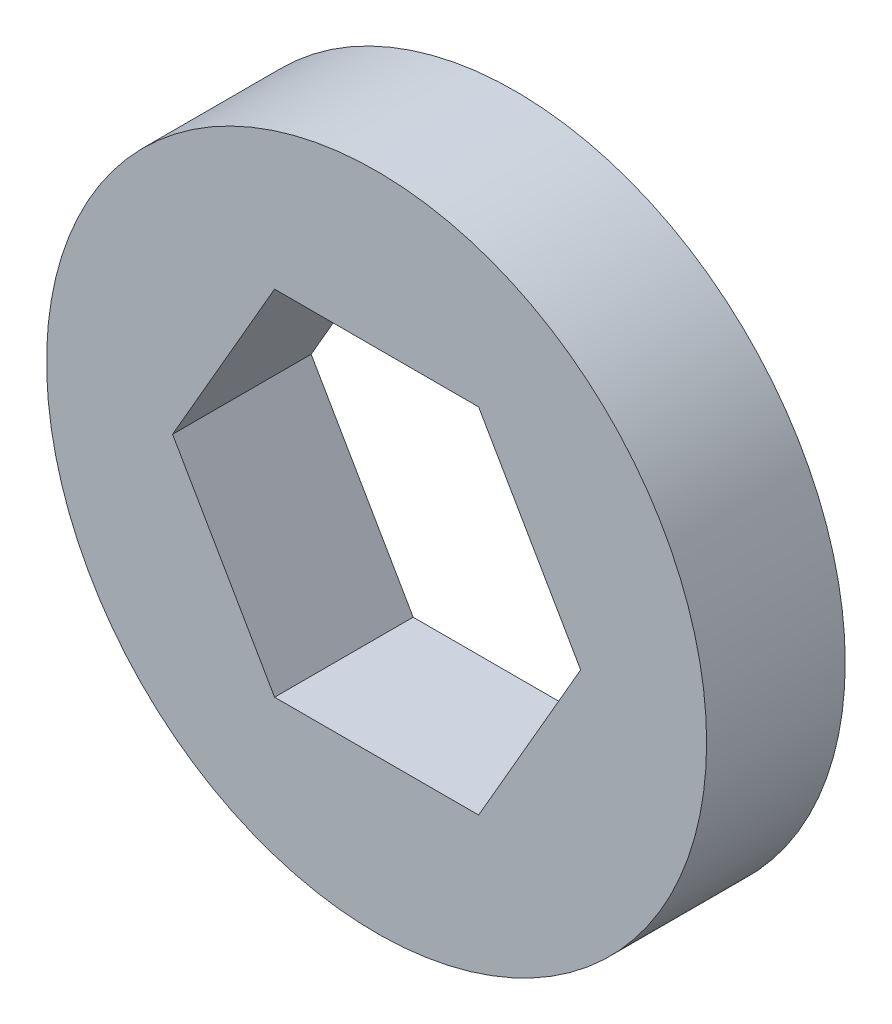
ISO-10303-21;
HEADER;
FILE_DESCRIPTION(('STEP AP214'),'2;1');
FILE_NAME('part.step','',(''),(''),'','','');
FILE_SCHEMA(('AUTOMOTIVE_DESIGN { 1 0 10303 214 1 1 1 1 }'));
ENDSEC;
DATA;
#1=APPLICATION_CONTEXT('core data for automotive mechanical design processes');
#2=APPLICATION_PROTOCOL_DEFINITION('international standard','automotive_design',2000,#1);
#3=PRODUCT_CONTEXT('',#1,'mechanical');
#4=PRODUCT('Part','Part','',(#3));
#5=PRODUCT_RELATED_PRODUCT_CATEGORY('part','',(#4));
#6=PRODUCT_DEFINITION_FORMATION('','',#4);
#7=PRODUCT_DEFINITION_CONTEXT('part definition',#1,'design');
#8=PRODUCT_DEFINITION('design','',#6,#7);
#9=PRODUCT_DEFINITION_SHAPE('','',#8);
#10=(LENGTH_UNIT() NAMED_UNIT(*) SI_UNIT(.MILLI.,.METRE.));
#11=(NAMED_UNIT(*) PLANE_ANGLE_UNIT() SI_UNIT($,.RADIAN.));
#12=(NAMED_UNIT(*) SI_UNIT($,.STERADIAN.) SOLID_ANGLE_UNIT());
#13=UNCERTAINTY_MEASURE_WITH_UNIT(LENGTH_MEASURE(1.E-05),#10,'distance_accuracy_value','');
#14=(GEOMETRIC_REPRESENTATION_CONTEXT(3) GLOBAL_UNCERTAINTY_ASSIGNED_CONTEXT((#13)) GLOBAL_UNIT_ASSIGNED_CONTEXT((#10,
#11,#12)) REPRESENTATION_CONTEXT('',''));
#15=CARTESIAN_POINT('',(0.,0.,0.));
#16=DIRECTION('',(0.,0.,1.));
#17=DIRECTION('',(1.,0.,0.));
#18=AXIS2_PLACEMENT_3D('',#15,#16,#17);
#19=CARTESIAN_POINT('',(0.,0.,2.));
#20=DIRECTION('',(0.,0.,1.));
#21=DIRECTION('',(1.,0.,0.));
#22=AXIS2_PLACEMENT_3D('',#19,#20,#21);
#23=PLANE('',#22);
#24=CARTESIAN_POINT('',(0.,0.,2.));
#25=DIRECTION('',(0.,0.,1.));
#26=DIRECTION('',(1.,0.,0.));
#27=AXIS2_PLACEMENT_3D('',#24,#25,#26);
#28=CIRCLE('',#27,4.7625);
#29=CARTESIAN_POINT('',(4.7625,0.,2.));
#30=VERTEX_POINT('',#29);
#31=EDGE_CURVE('E11',#30,#30,#28,.T.);
#32=ORIENTED_EDGE('',*,*,#31,.T.);
#33=EDGE_LOOP('',(#32));
#34=FACE_BOUND('',#33,.T.);
#35=DIRECTION('',(-0.5,0.866025403784438,0.));
#36=VECTOR('',#35,1.);
#37=CARTESIAN_POINT('',(2.94448637286709,0.,2.));
#38=LINE('',#37,#36);
#39=CARTESIAN_POINT('',(2.94448637286709,0.,2.));
#40=VERTEX_POINT('',#39);
#41=CARTESIAN_POINT('',(1.47224318643354,2.55,2.));
#42=VERTEX_POINT('',#41);
#43=EDGE_CURVE('E102',#40,#42,#38,.T.);
#44=ORIENTED_EDGE('',*,*,#43,.F.);
#45=DIRECTION('',(0.5,0.866025403784439,0.));
#46=VECTOR('',#45,1.);
#47=CARTESIAN_POINT('',(1.47224318643355,-2.55,2.));
#48=LINE('',#47,#46);
#49=CARTESIAN_POINT('',(1.47224318643355,-2.55,2.));
#50=VERTEX_POINT('',#49);
#51=EDGE_CURVE('E94',#50,#40,#48,.T.);
#52=ORIENTED_EDGE('',*,*,#51,.F.);
#53=DIRECTION('',(1.,0.,0.));
#54=VECTOR('',#53,1.);
#55=CARTESIAN_POINT('',(-1.47224318643354,-2.55,2.));
#56=LINE('',#55,#54);
#57=CARTESIAN_POINT('',(-1.47224318643354,-2.55,2.));
#58=VERTEX_POINT('',#57);
#59=EDGE_CURVE('E122',#58,#50,#56,.T.);
#60=ORIENTED_EDGE('',*,*,#59,.F.);
#61=DIRECTION('',(0.5,-0.866025403784439,0.));
#62=VECTOR('',#61,1.);
#63=CARTESIAN_POINT('',(-2.94448637286709,0.,2.));
#64=LINE('',#63,#62);
#65=CARTESIAN_POINT('',(-2.94448637286709,0.,2.));
#66=VERTEX_POINT('',#65);
#67=EDGE_CURVE('E120',#66,#58,#64,.T.);
#68=ORIENTED_EDGE('',*,*,#67,.F.);
#69=DIRECTION('',(-0.5,-0.866025403784439,0.));
#70=VECTOR('',#69,1.);
#71=CARTESIAN_POINT('',(-1.47224318643355,2.55,2.));
#72=LINE('',#71,#70);
#73=CARTESIAN_POINT('',(-1.47224318643355,2.55,2.));
#74=VERTEX_POINT('',#73);
#75=EDGE_CURVE('E116',#74,#66,#72,.T.);
#76=ORIENTED_EDGE('',*,*,#75,.F.);
#77=DIRECTION('',(-1.,0.,0.));
#78=VECTOR('',#77,1.);
#79=CARTESIAN_POINT('',(1.47224318643354,2.55,2.));
#80=LINE('',#79,#78);
#81=EDGE_CURVE('E114',#42,#74,#80,.T.);
#82=ORIENTED_EDGE('',*,*,#81,.F.);
#83=EDGE_LOOP('',(#44,#52,#60,#68,#76,#82));
#84=FACE_BOUND('',#83,.T.);
#85=ADVANCED_FACE('F41',(#34,#84),#23,.T.);
#86=CARTESIAN_POINT('',(0.,0.,0.));
#87=DIRECTION('',(0.,0.,1.));
#88=DIRECTION('',(1.,0.,0.));
#89=AXIS2_PLACEMENT_3D('',#86,#87,#88);
#90=PLANE('',#89);
#91=CARTESIAN_POINT('',(0.,0.,0.));
#92=DIRECTION('',(0.,0.,1.));
#93=DIRECTION('',(1.,0.,0.));
#94=AXIS2_PLACEMENT_3D('',#91,#92,#93);
#95=CIRCLE('',#94,4.7625);
#96=CARTESIAN_POINT('',(4.7625,0.,0.));
#97=VERTEX_POINT('',#96);
#98=EDGE_CURVE('E45',#97,#97,#95,.T.);
#99=ORIENTED_EDGE('',*,*,#98,.F.);
#100=EDGE_LOOP('',(#99));
#101=FACE_BOUND('',#100,.T.);
#102=DIRECTION('',(0.5,0.866025403784439,0.));
#103=VECTOR('',#102,1.);
#104=CARTESIAN_POINT('',(1.47224318643355,-2.55,0.));
#105=LINE('',#104,#103);
#106=CARTESIAN_POINT('',(1.47224318643355,-2.55,0.));
#107=VERTEX_POINT('',#106);
#108=CARTESIAN_POINT('',(2.94448637286709,0.,0.));
#109=VERTEX_POINT('',#108);
#110=EDGE_CURVE('E64',#107,#109,#105,.T.);
#111=ORIENTED_EDGE('',*,*,#110,.T.);
#112=DIRECTION('',(-0.5,0.866025403784438,0.));
#113=VECTOR('',#112,1.);
#114=CARTESIAN_POINT('',(2.94448637286709,0.,0.));
#115=LINE('',#114,#113);
#116=CARTESIAN_POINT('',(1.47224318643354,2.55,0.));
#117=VERTEX_POINT('',#116);
#118=EDGE_CURVE('E109',#109,#117,#115,.T.);
#119=ORIENTED_EDGE('',*,*,#118,.T.);
#120=DIRECTION('',(-1.,0.,0.));
#121=VECTOR('',#120,1.);
#122=CARTESIAN_POINT('',(1.47224318643354,2.55,0.));
#123=LINE('',#122,#121);
#124=CARTESIAN_POINT('',(-1.47224318643355,2.55,0.));
#125=VERTEX_POINT('',#124);
#126=EDGE_CURVE('E126',#117,#125,#123,.T.);
#127=ORIENTED_EDGE('',*,*,#126,.T.);
#128=DIRECTION('',(-0.5,-0.866025403784439,0.));
#129=VECTOR('',#128,1.);
#130=CARTESIAN_POINT('',(-1.47224318643355,2.55,0.));
#131=LINE('',#130,#129);
#132=CARTESIAN_POINT('',(-2.94448637286709,0.,0.));
#133=VERTEX_POINT('',#132);
#134=EDGE_CURVE('E129',#125,#133,#131,.T.);
#135=ORIENTED_EDGE('',*,*,#134,.T.);
#136=DIRECTION('',(0.5,-0.866025403784439,0.));
#137=VECTOR('',#136,1.);
#138=CARTESIAN_POINT('',(-2.94448637286709,0.,0.));
#139=LINE('',#138,#137);
#140=CARTESIAN_POINT('',(-1.47224318643354,-2.55,0.));
#141=VERTEX_POINT('',#140);
#142=EDGE_CURVE('E132',#133,#141,#139,.T.);
#143=ORIENTED_EDGE('',*,*,#142,.T.);
#144=DIRECTION('',(1.,0.,0.));
#145=VECTOR('',#144,1.);
#146=CARTESIAN_POINT('',(-1.47224318643354,-2.55,0.));
#147=LINE('',#146,#145);
#148=EDGE_CURVE('E103',#141,#107,#147,.T.);
#149=ORIENTED_EDGE('',*,*,#148,.T.);
#150=EDGE_LOOP('',(#111,#119,#127,#135,#143,#149));
#151=FACE_BOUND('',#150,.T.);
#152=ADVANCED_FACE('F149',(#101,#151),#90,.F.);
#153=CARTESIAN_POINT('',(0.,0.,2.));
#154=DIRECTION('',(0.,0.,-1.));
#155=DIRECTION('',(-1.,0.,0.));
#156=AXIS2_PLACEMENT_3D('',#153,#154,#155);
#157=CYLINDRICAL_SURFACE('',#156,4.7625);
#158=ORIENTED_EDGE('',*,*,#31,.F.);
#159=EDGE_LOOP('',(#158));
#160=FACE_BOUND('',#159,.T.);
#161=ORIENTED_EDGE('',*,*,#98,.T.);
#162=EDGE_LOOP('',(#161));
#163=FACE_BOUND('',#162,.T.);
#164=ADVANCED_FACE('F43',(#160,#163),#157,.T.);
#165=CARTESIAN_POINT('',(1.47224318643355,-2.55,2.));
#166=DIRECTION('',(-0.866025403784439,0.5,0.));
#167=DIRECTION('',(-0.5,-0.866025403784439,0.));
#168=AXIS2_PLACEMENT_3D('',#165,#166,#167);
#169=PLANE('',#168);
#170=ORIENTED_EDGE('',*,*,#110,.F.);
#171=DIRECTION('',(0.,0.,-1.));
#172=VECTOR('',#171,1.);
#173=CARTESIAN_POINT('',(1.47224318643355,-2.55,2.));
#174=LINE('',#173,#172);
#175=EDGE_CURVE('E98',#50,#107,#174,.T.);
#176=ORIENTED_EDGE('',*,*,#175,.F.);
#177=ORIENTED_EDGE('',*,*,#51,.T.);
#178=DIRECTION('',(0.,0.,-1.));
#179=VECTOR('',#178,1.);
#180=CARTESIAN_POINT('',(2.94448637286709,0.,2.));
#181=LINE('',#180,#179);
#182=EDGE_CURVE('E97',#40,#109,#181,.T.);
#183=ORIENTED_EDGE('',*,*,#182,.T.);
#184=EDGE_LOOP('',(#170,#176,#177,#183));
#185=FACE_BOUND('',#184,.T.);
#186=ADVANCED_FACE('F96',(#185),#169,.T.);
#187=CARTESIAN_POINT('',(2.94448637286709,0.,2.));
#188=DIRECTION('',(-0.866025403784439,-0.5,0.));
#189=DIRECTION('',(0.5,-0.866025403784439,0.));
#190=AXIS2_PLACEMENT_3D('',#187,#188,#189);
#191=PLANE('',#190);
#192=ORIENTED_EDGE('',*,*,#118,.F.);
#193=ORIENTED_EDGE('',*,*,#182,.F.);
#194=ORIENTED_EDGE('',*,*,#43,.T.);
#195=DIRECTION('',(0.,0.,-1.));
#196=VECTOR('',#195,1.);
#197=CARTESIAN_POINT('',(1.47224318643354,2.55,2.));
#198=LINE('',#197,#196);
#199=EDGE_CURVE('E110',#42,#117,#198,.T.);
#200=ORIENTED_EDGE('',*,*,#199,.T.);
#201=EDGE_LOOP('',(#192,#193,#194,#200));
#202=FACE_BOUND('',#201,.T.);
#203=ADVANCED_FACE('F106',(#202),#191,.T.);
#204=CARTESIAN_POINT('',(1.47224318643354,2.55,2.));
#205=DIRECTION('',(0.,-1.,0.));
#206=DIRECTION('',(1.,0.,0.));
#207=AXIS2_PLACEMENT_3D('',#204,#205,#206);
#208=PLANE('',#207);
#209=ORIENTED_EDGE('',*,*,#126,.F.);
#210=ORIENTED_EDGE('',*,*,#199,.F.);
#211=ORIENTED_EDGE('',*,*,#81,.T.);
#212=DIRECTION('',(0.,0.,-1.));
#213=VECTOR('',#212,1.);
#214=CARTESIAN_POINT('',(-1.47224318643355,2.55,2.));
#215=LINE('',#214,#213);
#216=EDGE_CURVE('E141',#74,#125,#215,.T.);
#217=ORIENTED_EDGE('',*,*,#216,.T.);
#218=EDGE_LOOP('',(#209,#210,#211,#217));
#219=FACE_BOUND('',#218,.T.);
#220=ADVANCED_FACE('F145',(#219),#208,.T.);
#221=CARTESIAN_POINT('',(-1.47224318643355,2.55,2.));
#222=DIRECTION('',(0.866025403784439,-0.5,0.));
#223=DIRECTION('',(0.5,0.866025403784439,0.));
#224=AXIS2_PLACEMENT_3D('',#221,#222,#223);
#225=PLANE('',#224);
#226=ORIENTED_EDGE('',*,*,#134,.F.);
#227=ORIENTED_EDGE('',*,*,#216,.F.);
#228=ORIENTED_EDGE('',*,*,#75,.T.);
#229=DIRECTION('',(0.,0.,-1.));
#230=VECTOR('',#229,1.);
#231=CARTESIAN_POINT('',(-2.94448637286709,0.,2.));
#232=LINE('',#231,#230);
#233=EDGE_CURVE('E139',#66,#133,#232,.T.);
#234=ORIENTED_EDGE('',*,*,#233,.T.);
#235=EDGE_LOOP('',(#226,#227,#228,#234));
#236=FACE_BOUND('',#235,.T.);
#237=ADVANCED_FACE('F157',(#236),#225,.T.);
#238=CARTESIAN_POINT('',(-2.94448637286709,0.,2.));
#239=DIRECTION('',(0.866025403784439,0.5,0.));
#240=DIRECTION('',(-0.5,0.866025403784439,0.));
#241=AXIS2_PLACEMENT_3D('',#238,#239,#240);
#242=PLANE('',#241);
#243=ORIENTED_EDGE('',*,*,#142,.F.);
#244=ORIENTED_EDGE('',*,*,#233,.F.);
#245=ORIENTED_EDGE('',*,*,#67,.T.);
#246=DIRECTION('',(0.,0.,-1.));
#247=VECTOR('',#246,1.);
#248=CARTESIAN_POINT('',(-1.47224318643354,-2.55,2.));
#249=LINE('',#248,#247);
#250=EDGE_CURVE('E56',#58,#141,#249,.T.);
#251=ORIENTED_EDGE('',*,*,#250,.T.);
#252=EDGE_LOOP('',(#243,#244,#245,#251));
#253=FACE_BOUND('',#252,.T.);
#254=ADVANCED_FACE('F155',(#253),#242,.T.);
#255=CARTESIAN_POINT('',(-1.47224318643354,-2.55,2.));
#256=DIRECTION('',(0.,1.,0.));
#257=DIRECTION('',(0.,0.,1.));
#258=AXIS2_PLACEMENT_3D('',#255,#256,#257);
#259=PLANE('',#258);
#260=ORIENTED_EDGE('',*,*,#148,.F.);
#261=ORIENTED_EDGE('',*,*,#250,.F.);
#262=ORIENTED_EDGE('',*,*,#59,.T.);
#263=ORIENTED_EDGE('',*,*,#175,.T.);
#264=EDGE_LOOP('',(#260,#261,#262,#263));
#265=FACE_BOUND('',#264,.T.);
#266=ADVANCED_FACE('F151',(#265),#259,.T.);
#267=CLOSED_SHELL('',(#85,#152,#164,#186,#203,#220,#237,#254,#266));
#268=MANIFOLD_SOLID_BREP('B2',#267);
#269=ADVANCED_BREP_SHAPE_REPRESENTATION('',(#18,#268),#14);
#270=SHAPE_DEFINITION_REPRESENTATION(#9,#269);
ENDSEC;
END-ISO-10303-21;
